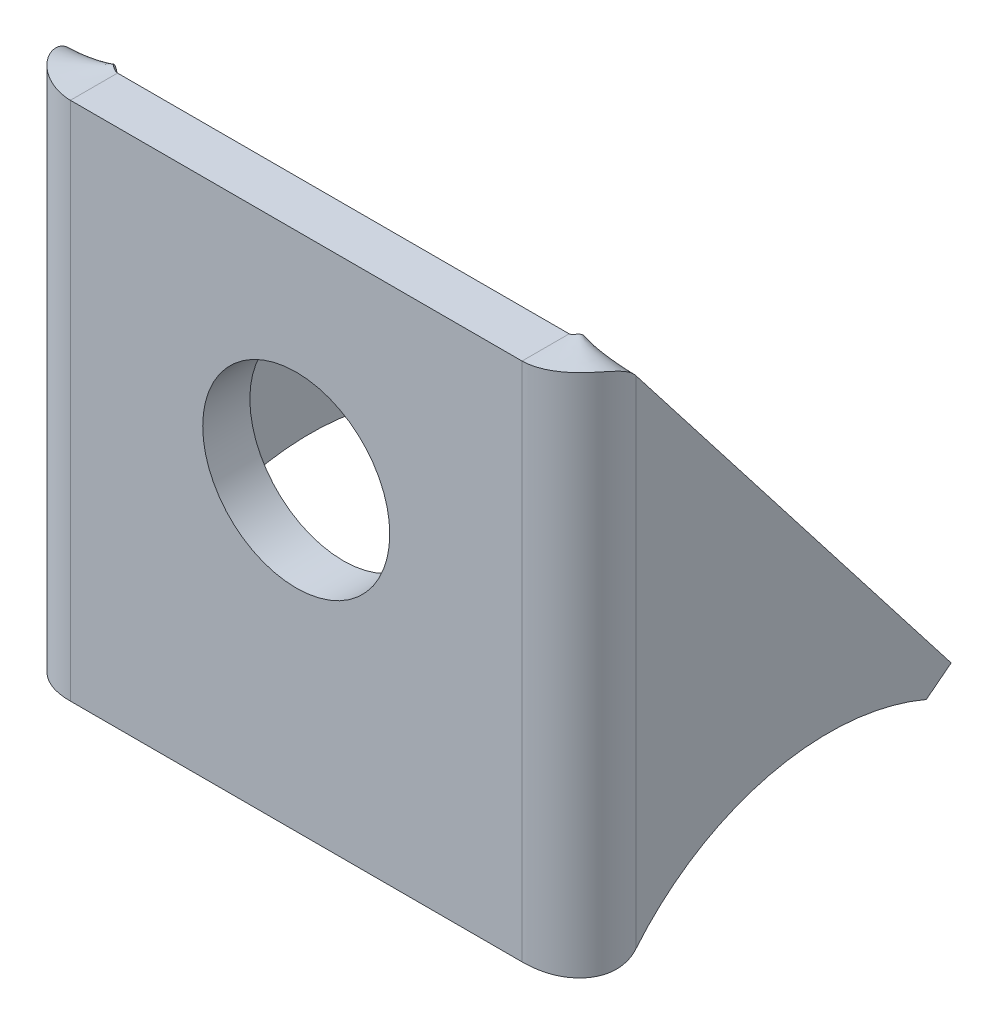
ISO-10303-21;
HEADER;
FILE_DESCRIPTION(('STEP AP214'),'2;1');
FILE_NAME('part.step','',(''),(''),'','','');
FILE_SCHEMA(('AUTOMOTIVE_DESIGN { 1 0 10303 214 1 1 1 1 }'));
ENDSEC;
DATA;
#1=APPLICATION_CONTEXT('core data for automotive mechanical design processes');
#2=APPLICATION_PROTOCOL_DEFINITION('international standard','automotive_design',2000,#1);
#3=PRODUCT_CONTEXT('',#1,'mechanical');
#4=PRODUCT('Part','Part','',(#3));
#5=PRODUCT_RELATED_PRODUCT_CATEGORY('part','',(#4));
#6=PRODUCT_DEFINITION_FORMATION('','',#4);
#7=PRODUCT_DEFINITION_CONTEXT('part definition',#1,'design');
#8=PRODUCT_DEFINITION('design','',#6,#7);
#9=PRODUCT_DEFINITION_SHAPE('','',#8);
#10=(LENGTH_UNIT() NAMED_UNIT(*) SI_UNIT(.MILLI.,.METRE.));
#11=(NAMED_UNIT(*) PLANE_ANGLE_UNIT() SI_UNIT($,.RADIAN.));
#12=(NAMED_UNIT(*) SI_UNIT($,.STERADIAN.) SOLID_ANGLE_UNIT());
#13=UNCERTAINTY_MEASURE_WITH_UNIT(LENGTH_MEASURE(1.E-05),#10,'distance_accuracy_value','');
#14=(GEOMETRIC_REPRESENTATION_CONTEXT(3) GLOBAL_UNCERTAINTY_ASSIGNED_CONTEXT((#13)) GLOBAL_UNIT_ASSIGNED_CONTEXT((#10,
#11,#12)) REPRESENTATION_CONTEXT('',''));
#15=CARTESIAN_POINT('',(0.,0.,0.));
#16=DIRECTION('',(0.,0.,1.));
#17=DIRECTION('',(1.,0.,0.));
#18=AXIS2_PLACEMENT_3D('',#15,#16,#17);
#19=CARTESIAN_POINT('',(-11.999,34.,12.7));
#20=DIRECTION('',(0.,1.,0.));
#21=DIRECTION('',(-1.,0.,0.));
#22=AXIS2_PLACEMENT_3D('',#19,#20,#21);
#23=PLANE('',#22);
#24=CARTESIAN_POINT('',(11.5,34.,10.3));
#25=CARTESIAN_POINT('',(11.5,34.,12.7));
#26=B_SPLINE_CURVE_WITH_KNOTS('',1,(#24,#25),.UNSPECIFIED.,.F.,.F.,(2,2),(0.,1.),.UNSPECIFIED.);
#27=CARTESIAN_POINT('',(11.5,34.,10.3));
#28=VERTEX_POINT('',#27);
#29=CARTESIAN_POINT('',(11.5,34.,12.7));
#30=VERTEX_POINT('',#29);
#31=EDGE_CURVE('E12',#28,#30,#26,.T.);
#32=ORIENTED_EDGE('',*,*,#31,.F.);
#33=DIRECTION('',(1.,0.,0.));
#34=VECTOR('',#33,1.);
#35=CARTESIAN_POINT('',(11.999,34.,10.3));
#36=LINE('',#35,#34);
#37=CARTESIAN_POINT('',(-11.5,34.,10.3));
#38=VERTEX_POINT('',#37);
#39=EDGE_CURVE('E99',#28,#38,#36,.F.);
#40=ORIENTED_EDGE('',*,*,#39,.T.);
#41=CARTESIAN_POINT('',(-11.5,34.,12.7));
#42=CARTESIAN_POINT('',(-11.5,34.,10.3));
#43=B_SPLINE_CURVE_WITH_KNOTS('',1,(#41,#42),.UNSPECIFIED.,.F.,.F.,(2,2),(0.,1.),.UNSPECIFIED.);
#44=CARTESIAN_POINT('',(-11.5,34.,12.7));
#45=VERTEX_POINT('',#44);
#46=EDGE_CURVE('E50',#38,#45,#43,.F.);
#47=ORIENTED_EDGE('',*,*,#46,.T.);
#48=DIRECTION('',(-1.,0.,0.));
#49=VECTOR('',#48,1.);
#50=CARTESIAN_POINT('',(-11.999,34.,12.7));
#51=LINE('',#50,#49);
#52=EDGE_CURVE('E101',#30,#45,#51,.T.);
#53=ORIENTED_EDGE('',*,*,#52,.F.);
#54=EDGE_LOOP('',(#32,#40,#47,#53));
#55=FACE_BOUND('',#54,.T.);
#56=ADVANCED_FACE('F39',(#55),#23,.T.);
#57=CARTESIAN_POINT('',(-14.4,33.3544187159252,9.8));
#58=CARTESIAN_POINT('',(-14.4,33.6272339418569,10.0116220503697));
#59=CARTESIAN_POINT('',(-14.3755891768856,33.8048267528989,10.3192827495326));
#60=CARTESIAN_POINT('',(-14.2156977628298,33.9724977222317,10.8330307754405));
#61=CARTESIAN_POINT('',(-14.1421114156717,34.0120743987745,11.0124346368787));
#62=CARTESIAN_POINT('',(-13.9486503511237,34.0663712051521,11.3667999040936));
#63=CARTESIAN_POINT('',(-13.8287340099057,34.0810913349868,11.5416092200898));
#64=CARTESIAN_POINT('',(-13.5465142008754,34.0934457943764,11.8659100633882));
#65=CARTESIAN_POINT('',(-13.3842742306756,34.0910801239311,12.0152426433838));
#66=CARTESIAN_POINT('',(-13.0308890049798,34.0770337291889,12.2726844117044));
#67=CARTESIAN_POINT('',(-12.8398903366036,34.0653530048918,12.3806958959673));
#68=CARTESIAN_POINT('',(-12.253205555839,34.0279943708652,12.6326438316524));
#69=CARTESIAN_POINT('',(-11.8451615196323,34.,12.7));
#70=CARTESIAN_POINT('',(-11.5,34.,12.7));
#71=CARTESIAN_POINT('',(-12.,33.3544187159252,9.8));
#72=CARTESIAN_POINT('',(-12.,33.6277654388444,9.8365576433068));
#73=CARTESIAN_POINT('',(-11.9957912373941,33.8048267528989,9.8895315085401));
#74=CARTESIAN_POINT('',(-11.968223752212,33.9724977222317,9.97810875438629));
#75=CARTESIAN_POINT('',(-11.9555364509779,34.0120743987745,10.0090404546343));
#76=CARTESIAN_POINT('',(-11.9221810950213,34.0663712051521,10.0701379144989));
#77=CARTESIAN_POINT('',(-11.9015058637768,34.0810913349868,10.1002774517396));
#78=CARTESIAN_POINT('',(-11.852847276013,34.0934457943764,10.1561913902393));
#79=CARTESIAN_POINT('',(-11.8248748673579,34.0910801239311,10.1819383867903));
#80=CARTESIAN_POINT('',(-11.7639463801689,34.0770337291889,10.2263248985697));
#81=CARTESIAN_POINT('',(-11.7310155752765,34.0653530048918,10.2449475682702));
#82=CARTESIAN_POINT('',(-11.6298630268688,34.0279943708652,10.2883868675263));
#83=CARTESIAN_POINT('',(-11.5595106068331,34.,10.3));
#84=CARTESIAN_POINT('',(-11.5,34.,10.3));
#85=B_SPLINE_SURFACE_WITH_KNOTS('',1,3,((#57,#58,#59,#60,#61,#62,#63,#64,#65,#66,#67,#68,#69,
#70),(#71,#72,#73,#74,#75,#76,#77,#78,#79,#80,#81,#82,#83,#84)),.UNSPECIFIED.,.F.,.F.,.F.,(2,2),
(4,2,2,2,2,2,4),(0.,1.),(0.,0.25,0.375,0.5,0.625,0.75,1.),.UNSPECIFIED.);
#86=CARTESIAN_POINT('',(-11.5,34.,10.3));
#87=CARTESIAN_POINT('',(-11.5595106068331,34.,10.3));
#88=CARTESIAN_POINT('',(-11.6298630268688,34.0279943708652,10.2883868675263));
#89=CARTESIAN_POINT('',(-11.7310155752765,34.0653530048918,10.2449475682702));
#90=CARTESIAN_POINT('',(-11.7639463801689,34.0770337291889,10.2263248985697));
#91=CARTESIAN_POINT('',(-11.8248748673579,34.0910801239311,10.1819383867903));
#92=CARTESIAN_POINT('',(-11.852847276013,34.0934457943764,10.1561913902393));
#93=CARTESIAN_POINT('',(-11.9015058637768,34.0810913349868,10.1002774517396));
#94=CARTESIAN_POINT('',(-11.9221810950213,34.0663712051521,10.0701379144989));
#95=CARTESIAN_POINT('',(-11.9555364509779,34.0120743987745,10.0090404546343));
#96=CARTESIAN_POINT('',(-11.968223752212,33.9724977222317,9.97810875438629));
#97=CARTESIAN_POINT('',(-11.9957912373941,33.8048267528989,9.8895315085401));
#98=CARTESIAN_POINT('',(-12.,33.6277654388444,9.8365576433068));
#99=CARTESIAN_POINT('',(-12.,33.3544187159252,9.8));
#100=B_SPLINE_CURVE_WITH_KNOTS('',3,(#86,#87,#88,#89,#90,#91,#92,#93,#94,#95,#96,#97,#98,#99),
.UNSPECIFIED.,.F.,.F.,(4,2,2,2,2,2,4),(0.,0.25,0.375,0.5,0.625,0.75,1.),.UNSPECIFIED.);
#101=CARTESIAN_POINT('',(-12.,33.3544187159252,9.8));
#102=VERTEX_POINT('',#101);
#103=EDGE_CURVE('E266',#38,#102,#100,.T.);
#104=CARTESIAN_POINT('',(-12.,33.3544187159252,9.8));
#105=CARTESIAN_POINT('',(-14.4,33.3544187159252,9.8));
#106=B_SPLINE_CURVE_WITH_KNOTS('',1,(#104,#105),.UNSPECIFIED.,.F.,.F.,(2,2),(0.,1.),.UNSPECIFIED.);
#107=CARTESIAN_POINT('',(-14.4,33.3544187159252,9.8));
#108=VERTEX_POINT('',#107);
#109=EDGE_CURVE('E235',#102,#108,#106,.T.);
#110=CARTESIAN_POINT('',(-14.4,33.3544187159252,9.8));
#111=CARTESIAN_POINT('',(-14.4,33.6272339418569,10.0116220503697));
#112=CARTESIAN_POINT('',(-14.3755891768856,33.8048267528989,10.3192827495326));
#113=CARTESIAN_POINT('',(-14.2156977628298,33.9724977222317,10.8330307754405));
#114=CARTESIAN_POINT('',(-14.1421114156717,34.0120743987745,11.0124346368787));
#115=CARTESIAN_POINT('',(-13.9486503511237,34.0663712051521,11.3667999040936));
#116=CARTESIAN_POINT('',(-13.8287340099057,34.0810913349868,11.5416092200898));
#117=CARTESIAN_POINT('',(-13.5465142008754,34.0934457943764,11.8659100633882));
#118=CARTESIAN_POINT('',(-13.3842742306756,34.0910801239311,12.0152426433838));
#119=CARTESIAN_POINT('',(-13.0308890049798,34.0770337291889,12.2726844117044));
#120=CARTESIAN_POINT('',(-12.8398903366036,34.0653530048918,12.3806958959673));
#121=CARTESIAN_POINT('',(-12.253205555839,34.0279943708652,12.6326438316524));
#122=CARTESIAN_POINT('',(-11.8451615196323,34.,12.7));
#123=CARTESIAN_POINT('',(-11.5,34.,12.7));
#124=B_SPLINE_CURVE_WITH_KNOTS('',3,(#110,#111,#112,#113,#114,#115,#116,#117,#118,#119,#120,
#121,#122,#123),.UNSPECIFIED.,.F.,.F.,(4,2,2,2,2,2,4),(0.,0.25,0.375,0.5,0.625,0.75,1.),.UNSPECIFIED.);
#125=EDGE_CURVE('E599',#45,#108,#124,.F.);
#126=ORIENTED_EDGE('',*,*,#46,.F.);
#127=ORIENTED_EDGE('',*,*,#103,.T.);
#128=ORIENTED_EDGE('',*,*,#109,.T.);
#129=ORIENTED_EDGE('',*,*,#125,.F.);
#130=EDGE_LOOP('',(#126,#127,#128,#129));
#131=FACE_BOUND('',#130,.T.);
#132=ADVANCED_FACE('F187',(#131),#85,.F.);
#133=CARTESIAN_POINT('',(-14.4,33.999,10.3));
#134=DIRECTION('',(0.,0.612915858671537,-0.790148182424621));
#135=DIRECTION('',(0.,-0.790148182424621,-0.612915858671537));
#136=AXIS2_PLACEMENT_3D('',#133,#134,#135);
#137=PLANE('',#136);
#138=ORIENTED_EDGE('',*,*,#109,.F.);
#139=DIRECTION('',(0.,-0.790148182424621,-0.612915858671537));
#140=VECTOR('',#139,1.);
#141=CARTESIAN_POINT('',(-12.,33.999,10.3));
#142=LINE('',#141,#140);
#143=CARTESIAN_POINT('',(-12.,12.659956388062,-6.25263978271329));
#144=VERTEX_POINT('',#143);
#145=EDGE_CURVE('E253',#102,#144,#142,.T.);
#146=ORIENTED_EDGE('',*,*,#145,.T.);
#147=DIRECTION('',(-1.,0.,0.));
#148=VECTOR('',#147,1.);
#149=CARTESIAN_POINT('',(-14.4,12.659956388062,-6.25263978271329));
#150=LINE('',#149,#148);
#151=CARTESIAN_POINT('',(-14.4,12.659956388062,-6.25263978271329));
#152=VERTEX_POINT('',#151);
#153=EDGE_CURVE('E260',#144,#152,#150,.T.);
#154=ORIENTED_EDGE('',*,*,#153,.T.);
#155=DIRECTION('',(0.,-0.790148182424621,-0.612915858671537));
#156=VECTOR('',#155,1.);
#157=CARTESIAN_POINT('',(-14.4,33.999,10.3));
#158=LINE('',#157,#156);
#159=EDGE_CURVE('E255',#108,#152,#158,.T.);
#160=ORIENTED_EDGE('',*,*,#159,.F.);
#161=EDGE_LOOP('',(#138,#146,#154,#160));
#162=FACE_BOUND('',#161,.T.);
#163=ADVANCED_FACE('F198',(#162),#137,.T.);
#164=CARTESIAN_POINT('',(-14.4,12.659956388062,-6.25263978271329));
#165=DIRECTION('',(0.,-0.790148182424621,-0.612915858671537));
#166=DIRECTION('',(0.,-0.612915858671537,0.790148182424621));
#167=AXIS2_PLACEMENT_3D('',#164,#165,#166);
#168=PLANE('',#167);
#169=ORIENTED_EDGE('',*,*,#153,.F.);
#170=DIRECTION('',(0.,-0.612915858671537,0.790148182424621));
#171=VECTOR('',#170,1.);
#172=CARTESIAN_POINT('',(-12.,12.659956388062,-6.25263978271329));
#173=LINE('',#172,#171);
#174=CARTESIAN_POINT('',(-12.,11.6792910141875,-4.9884026908339));
#175=VERTEX_POINT('',#174);
#176=EDGE_CURVE('E277',#144,#175,#173,.T.);
#177=ORIENTED_EDGE('',*,*,#176,.T.);
#178=DIRECTION('',(-1.,0.,0.));
#179=VECTOR('',#178,1.);
#180=CARTESIAN_POINT('',(-14.4,11.6792910141875,-4.9884026908339));
#181=LINE('',#180,#179);
#182=CARTESIAN_POINT('',(-14.4,11.6792910141875,-4.9884026908339));
#183=VERTEX_POINT('',#182);
#184=EDGE_CURVE('E360',#175,#183,#181,.T.);
#185=ORIENTED_EDGE('',*,*,#184,.T.);
#186=DIRECTION('',(0.,-0.612915858671537,0.790148182424621));
#187=VECTOR('',#186,1.);
#188=CARTESIAN_POINT('',(-14.4,12.659956388062,-6.25263978271329));
#189=LINE('',#188,#187);
#190=EDGE_CURVE('E375',#152,#183,#189,.T.);
#191=ORIENTED_EDGE('',*,*,#190,.F.);
#192=EDGE_LOOP('',(#169,#177,#185,#191));
#193=FACE_BOUND('',#192,.T.);
#194=ADVANCED_FACE('F381',(#193),#168,.T.);
#195=CARTESIAN_POINT('',(-14.4,0.,0.));
#196=DIRECTION('',(1.,0.,0.));
#197=DIRECTION('',(0.,0.,-1.));
#198=AXIS2_PLACEMENT_3D('',#195,#196,#197);
#199=CYLINDRICAL_SURFACE('',#198,12.7);
#200=ORIENTED_EDGE('',*,*,#184,.F.);
#201=CARTESIAN_POINT('',(-12.,0.,0.));
#202=DIRECTION('',(1.,0.,0.));
#203=DIRECTION('',(0.,0.,-1.));
#204=AXIS2_PLACEMENT_3D('',#201,#202,#203);
#205=CIRCLE('',#204,12.7);
#206=CARTESIAN_POINT('',(-12.,8.07774721070176,9.8));
#207=VERTEX_POINT('',#206);
#208=EDGE_CURVE('E278',#175,#207,#205,.T.);
#209=ORIENTED_EDGE('',*,*,#208,.T.);
#210=CARTESIAN_POINT('',(-14.4,8.07774721070176,9.8));
#211=CARTESIAN_POINT('',(-12.,8.07774721070176,9.8));
#212=B_SPLINE_CURVE_WITH_KNOTS('',1,(#210,#211),.UNSPECIFIED.,.F.,.F.,(2,2),(0.,1.),.UNSPECIFIED.);
#213=CARTESIAN_POINT('',(-14.4,8.07774721070176,9.8));
#214=VERTEX_POINT('',#213);
#215=EDGE_CURVE('E288',#207,#214,#212,.F.);
#216=ORIENTED_EDGE('',*,*,#215,.T.);
#217=CARTESIAN_POINT('',(-14.4,0.,0.));
#218=DIRECTION('',(1.,0.,0.));
#219=DIRECTION('',(0.,0.,1.));
#220=AXIS2_PLACEMENT_3D('',#217,#218,#219);
#221=CIRCLE('',#220,12.7);
#222=EDGE_CURVE('E379',#183,#214,#221,.T.);
#223=ORIENTED_EDGE('',*,*,#222,.F.);
#224=EDGE_LOOP('',(#200,#209,#216,#223));
#225=FACE_BOUND('',#224,.T.);
#226=ADVANCED_FACE('F311',(#225),#199,.F.);
#227=CARTESIAN_POINT('',(-11.5,7.5,12.7));
#228=CARTESIAN_POINT('',(-11.8443490224359,7.5,12.7));
#229=CARTESIAN_POINT('',(-12.2500156766089,7.46952653395451,12.6331169511844));
#230=CARTESIAN_POINT('',(-12.8337504691201,7.42592973537004,12.3837721415953));
#231=CARTESIAN_POINT('',(-13.0238793478807,7.41174970258918,12.2769054955016));
#232=CARTESIAN_POINT('',(-13.3761590634791,7.39206470378071,12.0220027608148));
#233=CARTESIAN_POINT('',(-13.538168214839,7.3865597377531,11.8740586066162));
#234=CARTESIAN_POINT('',(-13.9619416546544,7.39501333968815,11.3913008489007));
#235=CARTESIAN_POINT('',(-14.1564424239642,7.4339404076687,11.0178571343937));
#236=CARTESIAN_POINT('',(-14.3737192843519,7.6421420097468,10.3306598028632));
#237=CARTESIAN_POINT('',(-14.4,7.81197055597188,10.0190690440218));
#238=CARTESIAN_POINT('',(-14.4,8.07774721070176,9.8));
#239=CARTESIAN_POINT('',(-11.5,7.5,10.3));
#240=CARTESIAN_POINT('',(-11.5593705211096,7.5,10.3));
#241=CARTESIAN_POINT('',(-11.6293130476912,7.46952653395451,10.2884684398594));
#242=CARTESIAN_POINT('',(-11.7299569774345,7.42592973537004,10.2454779554475));
#243=CARTESIAN_POINT('',(-11.7627378186001,7.41174970258918,10.2270526716382));
#244=CARTESIAN_POINT('',(-11.8234757005998,7.39206470378071,10.1831039242784));
#245=CARTESIAN_POINT('',(-11.8514083129033,7.3865597377531,10.1575963114856));
#246=CARTESIAN_POINT('',(-11.9244726990783,7.39501333968815,10.0743622153277));
#247=CARTESIAN_POINT('',(-11.9580073144766,7.4339404076687,10.0099753679989));
#248=CARTESIAN_POINT('',(-11.9954688421296,7.6421420097468,9.89149306945918));
#249=CARTESIAN_POINT('',(-12.,7.81144365417535,9.83784540483693));
#250=CARTESIAN_POINT('',(-12.,8.07774721070176,9.8));
#251=B_SPLINE_SURFACE_WITH_KNOTS('',1,3,((#227,#228,#229,#230,#231,#232,#233,#234,#235,#236,
#237,#238),(#239,#240,#241,#242,#243,#244,#245,#246,#247,#248,#249,#250)),.UNSPECIFIED.,.F.,.F.,
.F.,(2,2),(4,2,2,2,2,4),(0.,1.),(0.,0.25,0.375,0.5,0.75,1.),.UNSPECIFIED.);
#252=CARTESIAN_POINT('',(-12.,8.07774721070176,9.8));
#253=CARTESIAN_POINT('',(-12.,7.81144365417535,9.83784540483693));
#254=CARTESIAN_POINT('',(-11.9954688421296,7.6421420097468,9.89149306945918));
#255=CARTESIAN_POINT('',(-11.9580073144766,7.4339404076687,10.0099753679989));
#256=CARTESIAN_POINT('',(-11.9244726990783,7.39501333968815,10.0743622153277));
#257=CARTESIAN_POINT('',(-11.8514083129033,7.3865597377531,10.1575963114856));
#258=CARTESIAN_POINT('',(-11.8234757005998,7.39206470378071,10.1831039242784));
#259=CARTESIAN_POINT('',(-11.7627378186001,7.41174970258918,10.2270526716382));
#260=CARTESIAN_POINT('',(-11.7299569774345,7.42592973537004,10.2454779554475));
#261=CARTESIAN_POINT('',(-11.6293130476912,7.46952653395451,10.2884684398594));
#262=CARTESIAN_POINT('',(-11.5593705211096,7.5,10.3));
#263=CARTESIAN_POINT('',(-11.5,7.5,10.3));
#264=B_SPLINE_CURVE_WITH_KNOTS('',3,(#252,#253,#254,#255,#256,#257,#258,#259,#260,#261,#262,
#263),.UNSPECIFIED.,.F.,.F.,(4,2,2,2,2,4),(0.,0.25,0.5,0.625,0.75,1.),.UNSPECIFIED.);
#265=CARTESIAN_POINT('',(-11.5,7.5,10.3));
#266=VERTEX_POINT('',#265);
#267=EDGE_CURVE('E143',#207,#266,#264,.T.);
#268=CARTESIAN_POINT('',(-11.5,7.5,10.3));
#269=CARTESIAN_POINT('',(-11.5,7.5,12.7));
#270=B_SPLINE_CURVE_WITH_KNOTS('',1,(#268,#269),.UNSPECIFIED.,.F.,.F.,(2,2),(0.,1.),.UNSPECIFIED.);
#271=CARTESIAN_POINT('',(-11.5,7.5,12.7));
#272=VERTEX_POINT('',#271);
#273=EDGE_CURVE('E284',#266,#272,#270,.T.);
#274=CARTESIAN_POINT('',(-11.5,7.5,12.7));
#275=CARTESIAN_POINT('',(-11.8443490224359,7.5,12.7));
#276=CARTESIAN_POINT('',(-12.2500156766089,7.46952653395451,12.6331169511844));
#277=CARTESIAN_POINT('',(-12.8337504691201,7.42592973537004,12.3837721415953));
#278=CARTESIAN_POINT('',(-13.0238793478807,7.41174970258918,12.2769054955016));
#279=CARTESIAN_POINT('',(-13.3761590634791,7.39206470378071,12.0220027608148));
#280=CARTESIAN_POINT('',(-13.538168214839,7.3865597377531,11.8740586066162));
#281=CARTESIAN_POINT('',(-13.9619416546544,7.39501333968815,11.3913008489007));
#282=CARTESIAN_POINT('',(-14.1564424239642,7.4339404076687,11.0178571343937));
#283=CARTESIAN_POINT('',(-14.3737192843519,7.6421420097468,10.3306598028632));
#284=CARTESIAN_POINT('',(-14.4,7.81197055597188,10.0190690440218));
#285=CARTESIAN_POINT('',(-14.4,8.07774721070176,9.8));
#286=B_SPLINE_CURVE_WITH_KNOTS('',3,(#274,#275,#276,#277,#278,#279,#280,#281,#282,#283,#284,
#285),.UNSPECIFIED.,.F.,.F.,(4,2,2,2,2,4),(0.,0.25,0.375,0.5,0.75,1.),.UNSPECIFIED.);
#287=EDGE_CURVE('E580',#214,#272,#286,.F.);
#288=ORIENTED_EDGE('',*,*,#215,.F.);
#289=ORIENTED_EDGE('',*,*,#267,.T.);
#290=ORIENTED_EDGE('',*,*,#273,.T.);
#291=ORIENTED_EDGE('',*,*,#287,.F.);
#292=EDGE_LOOP('',(#288,#289,#290,#291));
#293=FACE_BOUND('',#292,.T.);
#294=ADVANCED_FACE('F282',(#293),#251,.F.);
#295=CARTESIAN_POINT('',(-12.,7.5,12.7));
#296=DIRECTION('',(0.,-1.,0.));
#297=DIRECTION('',(1.,0.,0.));
#298=AXIS2_PLACEMENT_3D('',#295,#296,#297);
#299=PLANE('',#298);
#300=ORIENTED_EDGE('',*,*,#273,.F.);
#301=DIRECTION('',(1.,0.,0.));
#302=VECTOR('',#301,1.);
#303=CARTESIAN_POINT('',(11.999,7.5,10.3));
#304=LINE('',#303,#302);
#305=CARTESIAN_POINT('',(11.5,7.5,10.3));
#306=VERTEX_POINT('',#305);
#307=EDGE_CURVE('E134',#266,#306,#304,.T.);
#308=ORIENTED_EDGE('',*,*,#307,.T.);
#309=CARTESIAN_POINT('',(11.5,7.5,12.7));
#310=CARTESIAN_POINT('',(11.5,7.5,10.3));
#311=B_SPLINE_CURVE_WITH_KNOTS('',1,(#309,#310),.UNSPECIFIED.,.F.,.F.,(2,2),(0.,1.),.UNSPECIFIED.);
#312=CARTESIAN_POINT('',(11.5,7.5,12.7));
#313=VERTEX_POINT('',#312);
#314=EDGE_CURVE('E536',#306,#313,#311,.F.);
#315=ORIENTED_EDGE('',*,*,#314,.T.);
#316=DIRECTION('',(1.,0.,0.));
#317=VECTOR('',#316,1.);
#318=CARTESIAN_POINT('',(-12.,7.5,12.7));
#319=LINE('',#318,#317);
#320=EDGE_CURVE('E394',#272,#313,#319,.T.);
#321=ORIENTED_EDGE('',*,*,#320,.F.);
#322=EDGE_LOOP('',(#300,#308,#315,#321));
#323=FACE_BOUND('',#322,.T.);
#324=ADVANCED_FACE('F310',(#323),#299,.T.);
#325=CARTESIAN_POINT('',(14.4,8.07774721070176,9.8));
#326=CARTESIAN_POINT('',(14.4,7.81197055597189,10.0190690440218));
#327=CARTESIAN_POINT('',(14.3737192843519,7.6421420097468,10.3306598028632));
#328=CARTESIAN_POINT('',(14.1564424239642,7.4339404076687,11.0178571343937));
#329=CARTESIAN_POINT('',(13.9619416546544,7.39501333968815,11.3913008489007));
#330=CARTESIAN_POINT('',(13.538168214839,7.3865597377531,11.8740586066162));
#331=CARTESIAN_POINT('',(13.3761590634791,7.3920647037807,12.0220027608148));
#332=CARTESIAN_POINT('',(13.0238793478807,7.41174970258918,12.2769054955016));
#333=CARTESIAN_POINT('',(12.8337504691201,7.42592973537004,12.3837721415953));
#334=CARTESIAN_POINT('',(12.2500156766089,7.46952653395451,12.6331169511844));
#335=CARTESIAN_POINT('',(11.8443490224359,7.5,12.7));
#336=CARTESIAN_POINT('',(11.5,7.5,12.7));
#337=CARTESIAN_POINT('',(12.,8.07774721070176,9.8));
#338=CARTESIAN_POINT('',(12.,7.81144365417535,9.83784540483693));
#339=CARTESIAN_POINT('',(11.9954688421296,7.6421420097468,9.89149306945918));
#340=CARTESIAN_POINT('',(11.9580073144766,7.4339404076687,10.0099753679989));
#341=CARTESIAN_POINT('',(11.9244726990783,7.39501333968815,10.0743622153277));
#342=CARTESIAN_POINT('',(11.8514083129033,7.3865597377531,10.1575963114856));
#343=CARTESIAN_POINT('',(11.8234757005998,7.3920647037807,10.1831039242784));
#344=CARTESIAN_POINT('',(11.7627378186001,7.41174970258918,10.2270526716382));
#345=CARTESIAN_POINT('',(11.7299569774345,7.42592973537004,10.2454779554475));
#346=CARTESIAN_POINT('',(11.6293130476912,7.46952653395451,10.2884684398594));
#347=CARTESIAN_POINT('',(11.5593705211096,7.5,10.3));
#348=CARTESIAN_POINT('',(11.5,7.5,10.3));
#349=B_SPLINE_SURFACE_WITH_KNOTS('',1,3,((#325,#326,#327,#328,#329,#330,#331,#332,#333,#334,
#335,#336),(#337,#338,#339,#340,#341,#342,#343,#344,#345,#346,#347,#348)),.UNSPECIFIED.,.F.,.F.,
.F.,(2,2),(4,2,2,2,2,4),(0.,1.),(0.,0.25,0.5,0.625,0.75,1.),.UNSPECIFIED.);
#350=CARTESIAN_POINT('',(11.5,7.5,10.3));
#351=CARTESIAN_POINT('',(11.5593705211096,7.5,10.3));
#352=CARTESIAN_POINT('',(11.6293130476912,7.46952653395451,10.2884684398594));
#353=CARTESIAN_POINT('',(11.7299569774345,7.42592973537004,10.2454779554475));
#354=CARTESIAN_POINT('',(11.7627378186001,7.41174970258918,10.2270526716382));
#355=CARTESIAN_POINT('',(11.8234757005998,7.3920647037807,10.1831039242784));
#356=CARTESIAN_POINT('',(11.8514083129033,7.3865597377531,10.1575963114856));
#357=CARTESIAN_POINT('',(11.9244726990783,7.39501333968815,10.0743622153277));
#358=CARTESIAN_POINT('',(11.9580073144766,7.4339404076687,10.0099753679989));
#359=CARTESIAN_POINT('',(11.9954688421296,7.6421420097468,9.89149306945918));
#360=CARTESIAN_POINT('',(12.,7.81144365417535,9.83784540483693));
#361=CARTESIAN_POINT('',(12.,8.07774721070176,9.8));
#362=B_SPLINE_CURVE_WITH_KNOTS('',3,(#350,#351,#352,#353,#354,#355,#356,#357,#358,#359,#360,
#361),.UNSPECIFIED.,.F.,.F.,(4,2,2,2,2,4),(0.,0.25,0.375,0.5,0.75,1.),.UNSPECIFIED.);
#363=CARTESIAN_POINT('',(12.,8.07774721070176,9.8));
#364=VERTEX_POINT('',#363);
#365=EDGE_CURVE('E121',#306,#364,#362,.T.);
#366=CARTESIAN_POINT('',(12.,8.07774721070176,9.8));
#367=CARTESIAN_POINT('',(14.4,8.07774721070176,9.8));
#368=B_SPLINE_CURVE_WITH_KNOTS('',1,(#366,#367),.UNSPECIFIED.,.F.,.F.,(2,2),(0.,1.),.UNSPECIFIED.);
#369=CARTESIAN_POINT('',(14.4,8.07774721070176,9.8));
#370=VERTEX_POINT('',#369);
#371=EDGE_CURVE('E525',#364,#370,#368,.T.);
#372=CARTESIAN_POINT('',(14.4,8.07774721070176,9.8));
#373=CARTESIAN_POINT('',(14.4,7.81197055597189,10.0190690440218));
#374=CARTESIAN_POINT('',(14.3737192843519,7.6421420097468,10.3306598028632));
#375=CARTESIAN_POINT('',(14.1564424239642,7.4339404076687,11.0178571343937));
#376=CARTESIAN_POINT('',(13.9619416546544,7.39501333968815,11.3913008489007));
#377=CARTESIAN_POINT('',(13.538168214839,7.3865597377531,11.8740586066162));
#378=CARTESIAN_POINT('',(13.3761590634791,7.3920647037807,12.0220027608148));
#379=CARTESIAN_POINT('',(13.0238793478807,7.41174970258918,12.2769054955016));
#380=CARTESIAN_POINT('',(12.8337504691201,7.42592973537004,12.3837721415953));
#381=CARTESIAN_POINT('',(12.2500156766089,7.46952653395451,12.6331169511844));
#382=CARTESIAN_POINT('',(11.8443490224359,7.5,12.7));
#383=CARTESIAN_POINT('',(11.5,7.5,12.7));
#384=B_SPLINE_CURVE_WITH_KNOTS('',3,(#372,#373,#374,#375,#376,#377,#378,#379,#380,#381,#382,
#383),.UNSPECIFIED.,.F.,.F.,(4,2,2,2,2,4),(0.,0.25,0.5,0.625,0.75,1.),.UNSPECIFIED.);
#385=EDGE_CURVE('E382',#313,#370,#384,.F.);
#386=ORIENTED_EDGE('',*,*,#314,.F.);
#387=ORIENTED_EDGE('',*,*,#365,.T.);
#388=ORIENTED_EDGE('',*,*,#371,.T.);
#389=ORIENTED_EDGE('',*,*,#385,.F.);
#390=EDGE_LOOP('',(#386,#387,#388,#389));
#391=FACE_BOUND('',#390,.T.);
#392=ADVANCED_FACE('F486',(#391),#349,.F.);
#393=CARTESIAN_POINT('',(14.4,0.,0.));
#394=DIRECTION('',(1.,0.,0.));
#395=DIRECTION('',(0.,0.,-1.));
#396=AXIS2_PLACEMENT_3D('',#393,#394,#395);
#397=CYLINDRICAL_SURFACE('',#396,12.7);
#398=ORIENTED_EDGE('',*,*,#371,.F.);
#399=CARTESIAN_POINT('',(12.,0.,0.));
#400=DIRECTION('',(1.,0.,0.));
#401=DIRECTION('',(0.,0.,-1.));
#402=AXIS2_PLACEMENT_3D('',#399,#400,#401);
#403=CIRCLE('',#402,12.7);
#404=CARTESIAN_POINT('',(12.,11.6792910141875,-4.9884026908339));
#405=VERTEX_POINT('',#404);
#406=EDGE_CURVE('E127',#405,#364,#403,.T.);
#407=ORIENTED_EDGE('',*,*,#406,.F.);
#408=DIRECTION('',(1.,0.,0.));
#409=VECTOR('',#408,1.);
#410=CARTESIAN_POINT('',(14.4,11.6792910141875,-4.9884026908339));
#411=LINE('',#410,#409);
#412=CARTESIAN_POINT('',(14.4,11.6792910141875,-4.9884026908339));
#413=VERTEX_POINT('',#412);
#414=EDGE_CURVE('E553',#405,#413,#411,.T.);
#415=ORIENTED_EDGE('',*,*,#414,.T.);
#416=CARTESIAN_POINT('',(14.4,0.,0.));
#417=DIRECTION('',(1.,0.,0.));
#418=DIRECTION('',(0.,0.,1.));
#419=AXIS2_PLACEMENT_3D('',#416,#417,#418);
#420=CIRCLE('',#419,12.7);
#421=EDGE_CURVE('E413',#413,#370,#420,.T.);
#422=ORIENTED_EDGE('',*,*,#421,.T.);
#423=EDGE_LOOP('',(#398,#407,#415,#422));
#424=FACE_BOUND('',#423,.T.);
#425=ADVANCED_FACE('F497',(#424),#397,.F.);
#426=CARTESIAN_POINT('',(14.4,12.659956388062,-6.25263978271329));
#427=DIRECTION('',(0.,0.790148182424621,0.612915858671537));
#428=DIRECTION('',(0.,-0.612915858671537,0.790148182424621));
#429=AXIS2_PLACEMENT_3D('',#426,#427,#428);
#430=PLANE('',#429);
#431=ORIENTED_EDGE('',*,*,#414,.F.);
#432=DIRECTION('',(0.,-0.612915858671537,0.790148182424621));
#433=VECTOR('',#432,1.);
#434=CARTESIAN_POINT('',(12.,12.659956388062,-6.25263978271329));
#435=LINE('',#434,#433);
#436=CARTESIAN_POINT('',(12.,12.659956388062,-6.25263978271329));
#437=VERTEX_POINT('',#436);
#438=EDGE_CURVE('E395',#437,#405,#435,.T.);
#439=ORIENTED_EDGE('',*,*,#438,.F.);
#440=DIRECTION('',(1.,0.,0.));
#441=VECTOR('',#440,1.);
#442=CARTESIAN_POINT('',(14.4,12.659956388062,-6.25263978271329));
#443=LINE('',#442,#441);
#444=CARTESIAN_POINT('',(14.4,12.659956388062,-6.25263978271329));
#445=VERTEX_POINT('',#444);
#446=EDGE_CURVE('E152',#437,#445,#443,.T.);
#447=ORIENTED_EDGE('',*,*,#446,.T.);
#448=DIRECTION('',(0.,-0.612915858671537,0.790148182424621));
#449=VECTOR('',#448,1.);
#450=CARTESIAN_POINT('',(14.4,12.659956388062,-6.25263978271329));
#451=LINE('',#450,#449);
#452=EDGE_CURVE('E390',#445,#413,#451,.T.);
#453=ORIENTED_EDGE('',*,*,#452,.T.);
#454=EDGE_LOOP('',(#431,#439,#447,#453));
#455=FACE_BOUND('',#454,.T.);
#456=ADVANCED_FACE('F648',(#455),#430,.F.);
#457=CARTESIAN_POINT('',(14.4,33.999,10.3));
#458=DIRECTION('',(0.,-0.612915858671537,0.790148182424621));
#459=DIRECTION('',(0.,-0.790148182424621,-0.612915858671537));
#460=AXIS2_PLACEMENT_3D('',#457,#458,#459);
#461=PLANE('',#460);
#462=ORIENTED_EDGE('',*,*,#446,.F.);
#463=DIRECTION('',(0.,-0.790148182424621,-0.612915858671537));
#464=VECTOR('',#463,1.);
#465=CARTESIAN_POINT('',(12.,33.999,10.3));
#466=LINE('',#465,#464);
#467=CARTESIAN_POINT('',(12.,33.3544187159252,9.8));
#468=VERTEX_POINT('',#467);
#469=EDGE_CURVE('E398',#468,#437,#466,.T.);
#470=ORIENTED_EDGE('',*,*,#469,.F.);
#471=CARTESIAN_POINT('',(14.4,33.3544187159252,9.8));
#472=CARTESIAN_POINT('',(12.,33.3544187159252,9.8));
#473=B_SPLINE_CURVE_WITH_KNOTS('',1,(#471,#472),.UNSPECIFIED.,.F.,.F.,(2,2),(0.,1.),.UNSPECIFIED.);
#474=CARTESIAN_POINT('',(14.4,33.3544187159252,9.8));
#475=VERTEX_POINT('',#474);
#476=EDGE_CURVE('E141',#468,#475,#473,.F.);
#477=ORIENTED_EDGE('',*,*,#476,.T.);
#478=DIRECTION('',(0.,-0.790148182424621,-0.612915858671537));
#479=VECTOR('',#478,1.);
#480=CARTESIAN_POINT('',(14.4,33.999,10.3));
#481=LINE('',#480,#479);
#482=EDGE_CURVE('E393',#475,#445,#481,.T.);
#483=ORIENTED_EDGE('',*,*,#482,.T.);
#484=EDGE_LOOP('',(#462,#470,#477,#483));
#485=FACE_BOUND('',#484,.T.);
#486=ADVANCED_FACE('F644',(#485),#461,.F.);
#487=CARTESIAN_POINT('',(0.,23.,12.7));
#488=DIRECTION('',(0.,0.,1.));
#489=DIRECTION('',(1.,0.,0.));
#490=AXIS2_PLACEMENT_3D('',#487,#488,#489);
#491=CYLINDRICAL_SURFACE('',#490,4.7625);
#492=CARTESIAN_POINT('',(0.,23.,12.7));
#493=DIRECTION('',(0.,0.,1.));
#494=DIRECTION('',(1.,0.,0.));
#495=AXIS2_PLACEMENT_3D('',#492,#493,#494);
#496=CIRCLE('',#495,4.7625);
#497=CARTESIAN_POINT('',(4.7625,23.,12.7));
#498=VERTEX_POINT('',#497);
#499=EDGE_CURVE('E378',#498,#498,#496,.T.);
#500=ORIENTED_EDGE('',*,*,#499,.T.);
#501=EDGE_LOOP('',(#500));
#502=FACE_BOUND('',#501,.T.);
#503=CARTESIAN_POINT('',(0.,23.,10.3));
#504=DIRECTION('',(0.,0.,1.));
#505=DIRECTION('',(1.,0.,0.));
#506=AXIS2_PLACEMENT_3D('',#503,#504,#505);
#507=CIRCLE('',#506,4.7625);
#508=CARTESIAN_POINT('',(4.7625,23.,10.3));
#509=VERTEX_POINT('',#508);
#510=EDGE_CURVE('E135',#509,#509,#507,.T.);
#511=ORIENTED_EDGE('',*,*,#510,.F.);
#512=EDGE_LOOP('',(#511));
#513=FACE_BOUND('',#512,.T.);
#514=ADVANCED_FACE('F41',(#502,#513),#491,.F.);
#515=CARTESIAN_POINT('',(11.5,34.,12.7));
#516=CARTESIAN_POINT('',(11.8451615196323,34.,12.7));
#517=CARTESIAN_POINT('',(12.253205555839,34.0279943708652,12.6326438316524));
#518=CARTESIAN_POINT('',(12.8398903366036,34.0653530048918,12.3806958959673));
#519=CARTESIAN_POINT('',(13.0308890049798,34.0770337291889,12.2726844117044));
#520=CARTESIAN_POINT('',(13.3842742306756,34.0910801239311,12.0152426433838));
#521=CARTESIAN_POINT('',(13.5465142008754,34.0934457943764,11.8659100633882));
#522=CARTESIAN_POINT('',(13.8287340099057,34.0810913349868,11.5416092200898));
#523=CARTESIAN_POINT('',(13.9486503511237,34.0663712051521,11.3667999040936));
#524=CARTESIAN_POINT('',(14.1421114156717,34.0120743987745,11.0124346368787));
#525=CARTESIAN_POINT('',(14.2156977628298,33.9724977222317,10.8330307754405));
#526=CARTESIAN_POINT('',(14.3755891768856,33.8048267528989,10.3192827495326));
#527=CARTESIAN_POINT('',(14.4,33.6272339418569,10.0116220503697));
#528=CARTESIAN_POINT('',(14.4,33.3544187159252,9.8));
#529=CARTESIAN_POINT('',(11.5,34.,10.3));
#530=CARTESIAN_POINT('',(11.5595106068332,34.,10.3));
#531=CARTESIAN_POINT('',(11.6298630268688,34.0279943708652,10.2883868675263));
#532=CARTESIAN_POINT('',(11.7310155752765,34.0653530048918,10.2449475682702));
#533=CARTESIAN_POINT('',(11.7639463801689,34.0770337291889,10.2263248985697));
#534=CARTESIAN_POINT('',(11.8248748673579,34.0910801239311,10.1819383867903));
#535=CARTESIAN_POINT('',(11.852847276013,34.0934457943764,10.1561913902393));
#536=CARTESIAN_POINT('',(11.9015058637768,34.0810913349868,10.1002774517396));
#537=CARTESIAN_POINT('',(11.9221810950213,34.0663712051521,10.0701379144989));
#538=CARTESIAN_POINT('',(11.9555364509779,34.0120743987745,10.0090404546343));
#539=CARTESIAN_POINT('',(11.968223752212,33.9724977222317,9.97810875438629));
#540=CARTESIAN_POINT('',(11.9957912373941,33.8048267528989,9.8895315085401));
#541=CARTESIAN_POINT('',(12.,33.6277654388444,9.8365576433068));
#542=CARTESIAN_POINT('',(12.,33.3544187159252,9.8));
#543=B_SPLINE_SURFACE_WITH_KNOTS('',1,3,((#515,#516,#517,#518,#519,#520,#521,#522,#523,#524,
#525,#526,#527,#528),(#529,#530,#531,#532,#533,#534,#535,#536,#537,#538,#539,#540,#541,#542)),
.UNSPECIFIED.,.F.,.F.,.F.,(2,2),(4,2,2,2,2,2,4),(0.,1.),(0.,0.25,0.375,0.5,0.625,0.75,1.),.UNSPECIFIED.);
#544=CARTESIAN_POINT('',(12.,33.3544187159252,9.8));
#545=CARTESIAN_POINT('',(12.,33.6277654388444,9.8365576433068));
#546=CARTESIAN_POINT('',(11.9957912373941,33.8048267528989,9.8895315085401));
#547=CARTESIAN_POINT('',(11.968223752212,33.9724977222317,9.97810875438629));
#548=CARTESIAN_POINT('',(11.9555364509779,34.0120743987745,10.0090404546343));
#549=CARTESIAN_POINT('',(11.9221810950213,34.0663712051521,10.0701379144989));
#550=CARTESIAN_POINT('',(11.9015058637768,34.0810913349868,10.1002774517396));
#551=CARTESIAN_POINT('',(11.852847276013,34.0934457943764,10.1561913902393));
#552=CARTESIAN_POINT('',(11.8248748673579,34.0910801239311,10.1819383867903));
#553=CARTESIAN_POINT('',(11.7639463801689,34.0770337291889,10.2263248985697));
#554=CARTESIAN_POINT('',(11.7310155752765,34.0653530048918,10.2449475682702));
#555=CARTESIAN_POINT('',(11.6298630268688,34.0279943708652,10.2883868675263));
#556=CARTESIAN_POINT('',(11.5595106068332,34.,10.3));
#557=CARTESIAN_POINT('',(11.5,34.,10.3));
#558=B_SPLINE_CURVE_WITH_KNOTS('',3,(#544,#545,#546,#547,#548,#549,#550,#551,#552,#553,#554,
#555,#556,#557),.UNSPECIFIED.,.F.,.F.,(4,2,2,2,2,2,4),(0.,0.25,0.375,0.5,0.625,0.75,1.),.UNSPECIFIED.);
#559=EDGE_CURVE('E117',#468,#28,#558,.T.);
#560=CARTESIAN_POINT('',(11.5,34.,12.7));
#561=CARTESIAN_POINT('',(11.8451615196323,34.,12.7));
#562=CARTESIAN_POINT('',(12.253205555839,34.0279943708652,12.6326438316524));
#563=CARTESIAN_POINT('',(12.8398903366036,34.0653530048918,12.3806958959673));
#564=CARTESIAN_POINT('',(13.0308890049798,34.0770337291889,12.2726844117044));
#565=CARTESIAN_POINT('',(13.3842742306756,34.0910801239311,12.0152426433838));
#566=CARTESIAN_POINT('',(13.5465142008754,34.0934457943764,11.8659100633882));
#567=CARTESIAN_POINT('',(13.8287340099057,34.0810913349868,11.5416092200898));
#568=CARTESIAN_POINT('',(13.9486503511237,34.0663712051521,11.3667999040936));
#569=CARTESIAN_POINT('',(14.1421114156717,34.0120743987745,11.0124346368787));
#570=CARTESIAN_POINT('',(14.2156977628298,33.9724977222317,10.8330307754405));
#571=CARTESIAN_POINT('',(14.3755891768856,33.8048267528989,10.3192827495326));
#572=CARTESIAN_POINT('',(14.4,33.6272339418569,10.0116220503697));
#573=CARTESIAN_POINT('',(14.4,33.3544187159252,9.8));
#574=B_SPLINE_CURVE_WITH_KNOTS('',3,(#560,#561,#562,#563,#564,#565,#566,#567,#568,#569,#570,
#571,#572,#573),.UNSPECIFIED.,.F.,.F.,(4,2,2,2,2,2,4),(0.,0.25,0.375,0.5,0.625,0.75,1.),.UNSPECIFIED.);
#575=EDGE_CURVE('E386',#475,#30,#574,.F.);
#576=ORIENTED_EDGE('',*,*,#559,.T.);
#577=ORIENTED_EDGE('',*,*,#31,.T.);
#578=ORIENTED_EDGE('',*,*,#575,.F.);
#579=ORIENTED_EDGE('',*,*,#476,.F.);
#580=EDGE_LOOP('',(#576,#577,#578,#579));
#581=FACE_BOUND('',#580,.T.);
#582=ADVANCED_FACE('F139',(#581),#543,.F.);
#583=CARTESIAN_POINT('',(14.4,0.,0.));
#584=DIRECTION('',(1.,0.,0.));
#585=DIRECTION('',(0.,0.,1.));
#586=AXIS2_PLACEMENT_3D('',#583,#584,#585);
#587=PLANE('',#586);
#588=ORIENTED_EDGE('',*,*,#482,.F.);
#589=DIRECTION('',(0.,1.,0.));
#590=VECTOR('',#589,1.);
#591=CARTESIAN_POINT('',(14.4,0.,9.8));
#592=LINE('',#591,#590);
#593=EDGE_CURVE('E570',#475,#370,#592,.F.);
#594=ORIENTED_EDGE('',*,*,#593,.T.);
#595=ORIENTED_EDGE('',*,*,#421,.F.);
#596=ORIENTED_EDGE('',*,*,#452,.F.);
#597=EDGE_LOOP('',(#588,#594,#595,#596));
#598=FACE_BOUND('',#597,.T.);
#599=ADVANCED_FACE('F164',(#598),#587,.T.);
#600=CARTESIAN_POINT('',(11.999,33.999,12.7));
#601=DIRECTION('',(0.,0.,1.));
#602=DIRECTION('',(1.,0.,0.));
#603=AXIS2_PLACEMENT_3D('',#600,#601,#602);
#604=PLANE('',#603);
#605=ORIENTED_EDGE('',*,*,#499,.F.);
#606=EDGE_LOOP('',(#605));
#607=FACE_BOUND('',#606,.T.);
#608=ORIENTED_EDGE('',*,*,#52,.T.);
#609=DIRECTION('',(0.,1.,0.));
#610=VECTOR('',#609,1.);
#611=CARTESIAN_POINT('',(-11.5,33.999,12.7));
#612=LINE('',#611,#610);
#613=EDGE_CURVE('E561',#45,#272,#612,.F.);
#614=ORIENTED_EDGE('',*,*,#613,.T.);
#615=ORIENTED_EDGE('',*,*,#320,.T.);
#616=DIRECTION('',(0.,1.,0.));
#617=VECTOR('',#616,1.);
#618=CARTESIAN_POINT('',(11.5,33.999,12.7));
#619=LINE('',#618,#617);
#620=EDGE_CURVE('E630',#313,#30,#619,.T.);
#621=ORIENTED_EDGE('',*,*,#620,.T.);
#622=EDGE_LOOP('',(#608,#614,#615,#621));
#623=FACE_BOUND('',#622,.T.);
#624=ADVANCED_FACE('F732',(#607,#623),#604,.T.);
#625=CARTESIAN_POINT('',(-14.4,0.,0.));
#626=DIRECTION('',(-1.,0.,0.));
#627=DIRECTION('',(0.,0.,1.));
#628=AXIS2_PLACEMENT_3D('',#625,#626,#627);
#629=PLANE('',#628);
#630=ORIENTED_EDGE('',*,*,#222,.T.);
#631=DIRECTION('',(0.,1.,0.));
#632=VECTOR('',#631,1.);
#633=CARTESIAN_POINT('',(-14.4,0.,9.8));
#634=LINE('',#633,#632);
#635=EDGE_CURVE('E377',#214,#108,#634,.T.);
#636=ORIENTED_EDGE('',*,*,#635,.T.);
#637=ORIENTED_EDGE('',*,*,#159,.T.);
#638=ORIENTED_EDGE('',*,*,#190,.T.);
#639=EDGE_LOOP('',(#630,#636,#637,#638));
#640=FACE_BOUND('',#639,.T.);
#641=ADVANCED_FACE('F374',(#640),#629,.T.);
#642=CARTESIAN_POINT('',(11.5,33.999,9.8));
#643=DIRECTION('',(0.,1.,0.));
#644=DIRECTION('',(0.,0.,1.));
#645=AXIS2_PLACEMENT_3D('',#642,#643,#644);
#646=CYLINDRICAL_SURFACE('',#645,2.9);
#647=ORIENTED_EDGE('',*,*,#385,.T.);
#648=ORIENTED_EDGE('',*,*,#593,.F.);
#649=ORIENTED_EDGE('',*,*,#575,.T.);
#650=ORIENTED_EDGE('',*,*,#620,.F.);
#651=EDGE_LOOP('',(#647,#648,#649,#650));
#652=FACE_BOUND('',#651,.T.);
#653=ADVANCED_FACE('F416',(#652),#646,.T.);
#654=CARTESIAN_POINT('',(-11.5,0.,9.8));
#655=DIRECTION('',(0.,1.,0.));
#656=DIRECTION('',(0.,0.,1.));
#657=AXIS2_PLACEMENT_3D('',#654,#655,#656);
#658=CYLINDRICAL_SURFACE('',#657,2.9);
#659=ORIENTED_EDGE('',*,*,#287,.T.);
#660=ORIENTED_EDGE('',*,*,#613,.F.);
#661=ORIENTED_EDGE('',*,*,#125,.T.);
#662=ORIENTED_EDGE('',*,*,#635,.F.);
#663=EDGE_LOOP('',(#659,#660,#661,#662));
#664=FACE_BOUND('',#663,.T.);
#665=ADVANCED_FACE('F426',(#664),#658,.T.);
#666=CARTESIAN_POINT('',(12.,0.,0.));
#667=DIRECTION('',(1.,0.,0.));
#668=DIRECTION('',(0.,0.,1.));
#669=AXIS2_PLACEMENT_3D('',#666,#667,#668);
#670=PLANE('',#669);
#671=ORIENTED_EDGE('',*,*,#469,.T.);
#672=ORIENTED_EDGE('',*,*,#438,.T.);
#673=ORIENTED_EDGE('',*,*,#406,.T.);
#674=DIRECTION('',(0.,-1.,0.));
#675=VECTOR('',#674,1.);
#676=CARTESIAN_POINT('',(12.,0.,9.8));
#677=LINE('',#676,#675);
#678=EDGE_CURVE('E126',#468,#364,#677,.T.);
#679=ORIENTED_EDGE('',*,*,#678,.F.);
#680=EDGE_LOOP('',(#671,#672,#673,#679));
#681=FACE_BOUND('',#680,.T.);
#682=ADVANCED_FACE('F647',(#681),#670,.F.);
#683=CARTESIAN_POINT('',(11.999,33.999,10.3));
#684=DIRECTION('',(0.,0.,1.));
#685=DIRECTION('',(1.,0.,0.));
#686=AXIS2_PLACEMENT_3D('',#683,#684,#685);
#687=PLANE('',#686);
#688=ORIENTED_EDGE('',*,*,#510,.T.);
#689=EDGE_LOOP('',(#688));
#690=FACE_BOUND('',#689,.T.);
#691=ORIENTED_EDGE('',*,*,#39,.F.);
#692=DIRECTION('',(0.,1.,0.));
#693=VECTOR('',#692,1.);
#694=CARTESIAN_POINT('',(11.5,33.999,10.3));
#695=LINE('',#694,#693);
#696=EDGE_CURVE('E114',#306,#28,#695,.T.);
#697=ORIENTED_EDGE('',*,*,#696,.F.);
#698=ORIENTED_EDGE('',*,*,#307,.F.);
#699=DIRECTION('',(0.,1.,0.));
#700=VECTOR('',#699,1.);
#701=CARTESIAN_POINT('',(-11.5,33.999,10.3));
#702=LINE('',#701,#700);
#703=EDGE_CURVE('E132',#38,#266,#702,.F.);
#704=ORIENTED_EDGE('',*,*,#703,.F.);
#705=EDGE_LOOP('',(#691,#697,#698,#704));
#706=FACE_BOUND('',#705,.T.);
#707=ADVANCED_FACE('F130',(#690,#706),#687,.F.);
#708=CARTESIAN_POINT('',(-12.,0.,0.));
#709=DIRECTION('',(-1.,0.,0.));
#710=DIRECTION('',(0.,0.,1.));
#711=AXIS2_PLACEMENT_3D('',#708,#709,#710);
#712=PLANE('',#711);
#713=ORIENTED_EDGE('',*,*,#208,.F.);
#714=ORIENTED_EDGE('',*,*,#176,.F.);
#715=ORIENTED_EDGE('',*,*,#145,.F.);
#716=DIRECTION('',(0.,1.,0.));
#717=VECTOR('',#716,1.);
#718=CARTESIAN_POINT('',(-12.,0.,9.8));
#719=LINE('',#718,#717);
#720=EDGE_CURVE('E264',#207,#102,#719,.T.);
#721=ORIENTED_EDGE('',*,*,#720,.F.);
#722=EDGE_LOOP('',(#713,#714,#715,#721));
#723=FACE_BOUND('',#722,.T.);
#724=ADVANCED_FACE('F275',(#723),#712,.F.);
#725=CARTESIAN_POINT('',(11.5,33.999,9.8));
#726=DIRECTION('',(0.,1.,0.));
#727=DIRECTION('',(0.,0.,1.));
#728=AXIS2_PLACEMENT_3D('',#725,#726,#727);
#729=CYLINDRICAL_SURFACE('',#728,0.5);
#730=ORIENTED_EDGE('',*,*,#365,.F.);
#731=ORIENTED_EDGE('',*,*,#696,.T.);
#732=ORIENTED_EDGE('',*,*,#559,.F.);
#733=ORIENTED_EDGE('',*,*,#678,.T.);
#734=EDGE_LOOP('',(#730,#731,#732,#733));
#735=FACE_BOUND('',#734,.T.);
#736=ADVANCED_FACE('F115',(#735),#729,.F.);
#737=CARTESIAN_POINT('',(-11.5,0.,9.8));
#738=DIRECTION('',(0.,1.,0.));
#739=DIRECTION('',(0.,0.,1.));
#740=AXIS2_PLACEMENT_3D('',#737,#738,#739);
#741=CYLINDRICAL_SURFACE('',#740,0.5);
#742=ORIENTED_EDGE('',*,*,#267,.F.);
#743=ORIENTED_EDGE('',*,*,#720,.T.);
#744=ORIENTED_EDGE('',*,*,#103,.F.);
#745=ORIENTED_EDGE('',*,*,#703,.T.);
#746=EDGE_LOOP('',(#742,#743,#744,#745));
#747=FACE_BOUND('',#746,.T.);
#748=ADVANCED_FACE('F265',(#747),#741,.F.);
#749=CLOSED_SHELL('',(#56,#132,#163,#194,#226,#294,#324,#392,#425,#456,#486,#514,#582,#599,#624,
#641,#653,#665,#682,#707,#724,#736,#748));
#750=MANIFOLD_SOLID_BREP('B2',#749);
#751=ADVANCED_BREP_SHAPE_REPRESENTATION('',(#18,#750),#14);
#752=SHAPE_DEFINITION_REPRESENTATION(#9,#751);
ENDSEC;
END-ISO-10303-21;
